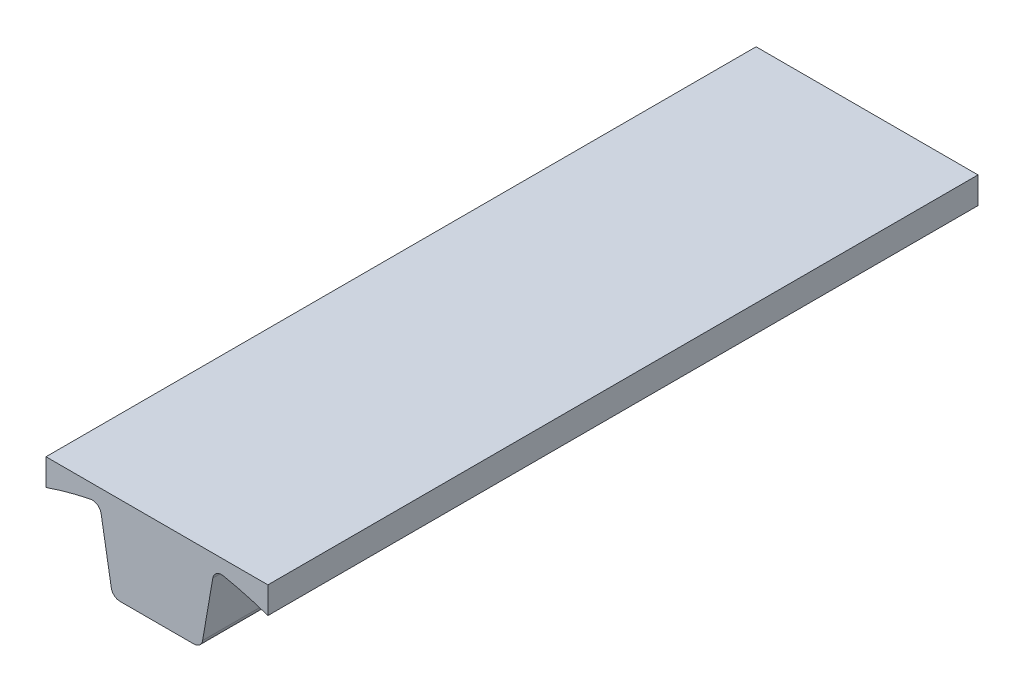
ISO-10303-21;
HEADER;
FILE_DESCRIPTION(('STEP AP214'),'2;1');
FILE_NAME('part.step','',(''),(''),'','','');
FILE_SCHEMA(('AUTOMOTIVE_DESIGN { 1 0 10303 214 1 1 1 1 }'));
ENDSEC;
DATA;
#1=APPLICATION_CONTEXT('core data for automotive mechanical design processes');
#2=APPLICATION_PROTOCOL_DEFINITION('international standard','automotive_design',2000,#1);
#3=PRODUCT_CONTEXT('',#1,'mechanical');
#4=PRODUCT('Part','Part','',(#3));
#5=PRODUCT_RELATED_PRODUCT_CATEGORY('part','',(#4));
#6=PRODUCT_DEFINITION_FORMATION('','',#4);
#7=PRODUCT_DEFINITION_CONTEXT('part definition',#1,'design');
#8=PRODUCT_DEFINITION('design','',#6,#7);
#9=PRODUCT_DEFINITION_SHAPE('','',#8);
#10=(LENGTH_UNIT() NAMED_UNIT(*) SI_UNIT(.MILLI.,.METRE.));
#11=(NAMED_UNIT(*) PLANE_ANGLE_UNIT() SI_UNIT($,.RADIAN.));
#12=(NAMED_UNIT(*) SI_UNIT($,.STERADIAN.) SOLID_ANGLE_UNIT());
#13=UNCERTAINTY_MEASURE_WITH_UNIT(LENGTH_MEASURE(1.E-05),#10,'distance_accuracy_value','');
#14=(GEOMETRIC_REPRESENTATION_CONTEXT(3) GLOBAL_UNCERTAINTY_ASSIGNED_CONTEXT((#13)) GLOBAL_UNIT_ASSIGNED_CONTEXT((#10,
#11,#12)) REPRESENTATION_CONTEXT('',''));
#15=CARTESIAN_POINT('',(0.,0.,0.));
#16=DIRECTION('',(0.,0.,1.));
#17=DIRECTION('',(1.,0.,0.));
#18=AXIS2_PLACEMENT_3D('',#15,#16,#17);
#19=CARTESIAN_POINT('',(12.7,73.8463201327698,203.2));
#20=DIRECTION('',(-0.985526486983063,0.169521513250743,0.));
#21=DIRECTION('',(-0.169521513250743,-0.985526486983063,0.));
#22=AXIS2_PLACEMENT_3D('',#19,#20,#21);
#23=PLANE('',#22);
#24=DIRECTION('',(0.169521513250743,0.985526486983063,0.));
#25=VECTOR('',#24,1.);
#26=CARTESIAN_POINT('',(12.7,73.8463201327698,203.2));
#27=LINE('',#26,#25);
#28=CARTESIAN_POINT('',(13.0628428946403,75.955735489113,203.2));
#29=VERTEX_POINT('',#28);
#30=CARTESIAN_POINT('',(15.9773459814521,92.8994256047058,203.2));
#31=VERTEX_POINT('',#30);
#32=EDGE_CURVE('E137',#29,#31,#27,.T.);
#33=ORIENTED_EDGE('',*,*,#32,.F.);
#34=DIRECTION('',(0.,0.,-1.));
#35=VECTOR('',#34,1.);
#36=CARTESIAN_POINT('',(13.0628428946403,75.955735489113,203.2));
#37=LINE('',#36,#35);
#38=CARTESIAN_POINT('',(13.0628428946403,75.955735489113,0.));
#39=VERTEX_POINT('',#38);
#40=EDGE_CURVE('E11',#29,#39,#37,.T.);
#41=ORIENTED_EDGE('',*,*,#40,.T.);
#42=DIRECTION('',(0.169521513250743,0.985526486983063,0.));
#43=VECTOR('',#42,1.);
#44=CARTESIAN_POINT('',(12.7,73.8463201327698,0.));
#45=LINE('',#44,#43);
#46=CARTESIAN_POINT('',(15.9773459814521,92.8994256047058,0.));
#47=VERTEX_POINT('',#46);
#48=EDGE_CURVE('E167',#39,#47,#45,.T.);
#49=ORIENTED_EDGE('',*,*,#48,.T.);
#50=DIRECTION('',(0.,0.,1.));
#51=VECTOR('',#50,1.);
#52=CARTESIAN_POINT('',(15.9773459814521,92.8994256047058,203.2));
#53=LINE('',#52,#51);
#54=EDGE_CURVE('E192',#47,#31,#53,.T.);
#55=ORIENTED_EDGE('',*,*,#54,.T.);
#56=EDGE_LOOP('',(#33,#41,#49,#55));
#57=FACE_BOUND('',#56,.T.);
#58=ADVANCED_FACE('F36',(#57),#23,.F.);
#59=CARTESIAN_POINT('',(0.,0.,203.2));
#60=DIRECTION('',(0.,0.,-1.));
#61=DIRECTION('',(-1.,0.,0.));
#62=AXIS2_PLACEMENT_3D('',#59,#60,#61);
#63=CYLINDRICAL_SURFACE('',#62,96.8375);
#64=CARTESIAN_POINT('',(0.,0.,203.2));
#65=DIRECTION('',(0.,0.,-1.));
#66=DIRECTION('',(-1.,0.,0.));
#67=AXIS2_PLACEMENT_3D('',#64,#65,#66);
#68=CIRCLE('',#67,96.8375);
#69=CARTESIAN_POINT('',(18.9783767468306,94.9595841519189,203.2));
#70=VERTEX_POINT('',#69);
#71=CARTESIAN_POINT('',(31.75,91.4846375423218,203.2));
#72=VERTEX_POINT('',#71);
#73=EDGE_CURVE('E126',#70,#72,#68,.T.);
#74=ORIENTED_EDGE('',*,*,#73,.F.);
#75=DIRECTION('',(0.,0.,-1.));
#76=VECTOR('',#75,1.);
#77=CARTESIAN_POINT('',(18.9783767468306,94.9595841519189,203.2));
#78=LINE('',#77,#76);
#79=CARTESIAN_POINT('',(18.9783767468306,94.9595841519189,0.));
#80=VERTEX_POINT('',#79);
#81=EDGE_CURVE('E146',#70,#80,#78,.T.);
#82=ORIENTED_EDGE('',*,*,#81,.T.);
#83=CARTESIAN_POINT('',(0.,0.,0.));
#84=DIRECTION('',(0.,0.,-1.));
#85=DIRECTION('',(-1.,0.,0.));
#86=AXIS2_PLACEMENT_3D('',#83,#84,#85);
#87=CIRCLE('',#86,96.8375);
#88=CARTESIAN_POINT('',(31.75,91.4846375423218,0.));
#89=VERTEX_POINT('',#88);
#90=EDGE_CURVE('E143',#80,#89,#87,.T.);
#91=ORIENTED_EDGE('',*,*,#90,.T.);
#92=DIRECTION('',(0.,0.,-1.));
#93=VECTOR('',#92,1.);
#94=CARTESIAN_POINT('',(31.75,91.4846375423218,203.2));
#95=LINE('',#94,#93);
#96=EDGE_CURVE('E140',#72,#89,#95,.T.);
#97=ORIENTED_EDGE('',*,*,#96,.F.);
#98=EDGE_LOOP('',(#74,#82,#91,#97));
#99=FACE_BOUND('',#98,.T.);
#100=ADVANCED_FACE('F141',(#99),#63,.F.);
#101=CARTESIAN_POINT('',(31.75,91.4846375423218,203.2));
#102=DIRECTION('',(-1.,0.,0.));
#103=DIRECTION('',(0.,0.,1.));
#104=AXIS2_PLACEMENT_3D('',#101,#102,#103);
#105=PLANE('',#104);
#106=DIRECTION('',(0.,1.,0.));
#107=VECTOR('',#106,1.);
#108=CARTESIAN_POINT('',(31.75,91.4846375423218,0.));
#109=LINE('',#108,#107);
#110=CARTESIAN_POINT('',(31.75,99.1046375423218,0.));
#111=VERTEX_POINT('',#110);
#112=EDGE_CURVE('E171',#89,#111,#109,.T.);
#113=ORIENTED_EDGE('',*,*,#112,.T.);
#114=DIRECTION('',(0.,0.,-1.));
#115=VECTOR('',#114,1.);
#116=CARTESIAN_POINT('',(31.75,99.1046375423218,203.2));
#117=LINE('',#116,#115);
#118=CARTESIAN_POINT('',(31.75,99.1046375423218,203.2));
#119=VERTEX_POINT('',#118);
#120=EDGE_CURVE('E147',#119,#111,#117,.T.);
#121=ORIENTED_EDGE('',*,*,#120,.F.);
#122=DIRECTION('',(0.,1.,0.));
#123=VECTOR('',#122,1.);
#124=CARTESIAN_POINT('',(31.75,91.4846375423218,203.2));
#125=LINE('',#124,#123);
#126=EDGE_CURVE('E130',#72,#119,#125,.T.);
#127=ORIENTED_EDGE('',*,*,#126,.F.);
#128=ORIENTED_EDGE('',*,*,#96,.T.);
#129=EDGE_LOOP('',(#113,#121,#127,#128));
#130=FACE_BOUND('',#129,.T.);
#131=ADVANCED_FACE('F149',(#130),#105,.F.);
#132=CARTESIAN_POINT('',(31.75,99.1046375423218,203.2));
#133=DIRECTION('',(0.,-1.,0.));
#134=DIRECTION('',(1.,0.,0.));
#135=AXIS2_PLACEMENT_3D('',#132,#133,#134);
#136=PLANE('',#135);
#137=DIRECTION('',(-1.,0.,0.));
#138=VECTOR('',#137,1.);
#139=CARTESIAN_POINT('',(31.75,99.1046375423218,0.));
#140=LINE('',#139,#138);
#141=CARTESIAN_POINT('',(-31.75,99.1046375423218,0.));
#142=VERTEX_POINT('',#141);
#143=EDGE_CURVE('E173',#111,#142,#140,.T.);
#144=ORIENTED_EDGE('',*,*,#143,.T.);
#145=DIRECTION('',(0.,0.,-1.));
#146=VECTOR('',#145,1.);
#147=CARTESIAN_POINT('',(-31.75,99.1046375423218,203.2));
#148=LINE('',#147,#146);
#149=CARTESIAN_POINT('',(-31.75,99.1046375423218,203.2));
#150=VERTEX_POINT('',#149);
#151=EDGE_CURVE('E187',#150,#142,#148,.T.);
#152=ORIENTED_EDGE('',*,*,#151,.F.);
#153=DIRECTION('',(-1.,0.,0.));
#154=VECTOR('',#153,1.);
#155=CARTESIAN_POINT('',(31.75,99.1046375423218,203.2));
#156=LINE('',#155,#154);
#157=EDGE_CURVE('E152',#119,#150,#156,.T.);
#158=ORIENTED_EDGE('',*,*,#157,.F.);
#159=ORIENTED_EDGE('',*,*,#120,.T.);
#160=EDGE_LOOP('',(#144,#152,#158,#159));
#161=FACE_BOUND('',#160,.T.);
#162=ADVANCED_FACE('F248',(#161),#136,.F.);
#163=CARTESIAN_POINT('',(-31.75,91.4846375423218,203.2));
#164=DIRECTION('',(1.,0.,0.));
#165=DIRECTION('',(0.,0.,-1.));
#166=AXIS2_PLACEMENT_3D('',#163,#164,#165);
#167=PLANE('',#166);
#168=DIRECTION('',(0.,-1.,0.));
#169=VECTOR('',#168,1.);
#170=CARTESIAN_POINT('',(-31.75,91.4846375423218,0.));
#171=LINE('',#170,#169);
#172=CARTESIAN_POINT('',(-31.75,91.4846375423218,0.));
#173=VERTEX_POINT('',#172);
#174=EDGE_CURVE('E175',#142,#173,#171,.T.);
#175=ORIENTED_EDGE('',*,*,#174,.T.);
#176=DIRECTION('',(0.,0.,-1.));
#177=VECTOR('',#176,1.);
#178=CARTESIAN_POINT('',(-31.75,91.4846375423218,203.2));
#179=LINE('',#178,#177);
#180=CARTESIAN_POINT('',(-31.75,91.4846375423218,203.2));
#181=VERTEX_POINT('',#180);
#182=EDGE_CURVE('E166',#181,#173,#179,.T.);
#183=ORIENTED_EDGE('',*,*,#182,.F.);
#184=DIRECTION('',(0.,-1.,0.));
#185=VECTOR('',#184,1.);
#186=CARTESIAN_POINT('',(-31.75,91.4846375423218,203.2));
#187=LINE('',#186,#185);
#188=EDGE_CURVE('E154',#150,#181,#187,.T.);
#189=ORIENTED_EDGE('',*,*,#188,.F.);
#190=ORIENTED_EDGE('',*,*,#151,.T.);
#191=EDGE_LOOP('',(#175,#183,#189,#190));
#192=FACE_BOUND('',#191,.T.);
#193=ADVANCED_FACE('F244',(#192),#167,.F.);
#194=CARTESIAN_POINT('',(0.,0.,203.2));
#195=DIRECTION('',(0.,0.,-1.));
#196=DIRECTION('',(-1.,0.,0.));
#197=AXIS2_PLACEMENT_3D('',#194,#195,#196);
#198=CYLINDRICAL_SURFACE('',#197,96.8374999999999);
#199=CARTESIAN_POINT('',(0.,0.,0.));
#200=DIRECTION('',(0.,0.,-1.));
#201=DIRECTION('',(1.,0.,0.));
#202=AXIS2_PLACEMENT_3D('',#199,#200,#201);
#203=CIRCLE('',#202,96.8374999999999);
#204=CARTESIAN_POINT('',(-18.9783767468306,94.9595841519188,0.));
#205=VERTEX_POINT('',#204);
#206=EDGE_CURVE('E177',#173,#205,#203,.T.);
#207=ORIENTED_EDGE('',*,*,#206,.T.);
#208=DIRECTION('',(0.,0.,-1.));
#209=VECTOR('',#208,1.);
#210=CARTESIAN_POINT('',(-18.9783767468306,94.9595841519188,203.2));
#211=LINE('',#210,#209);
#212=CARTESIAN_POINT('',(-18.9783767468306,94.9595841519188,203.2));
#213=VERTEX_POINT('',#212);
#214=EDGE_CURVE('E202',#205,#213,#211,.F.);
#215=ORIENTED_EDGE('',*,*,#214,.T.);
#216=CARTESIAN_POINT('',(0.,0.,203.2));
#217=DIRECTION('',(0.,0.,-1.));
#218=DIRECTION('',(1.,0.,0.));
#219=AXIS2_PLACEMENT_3D('',#216,#217,#218);
#220=CIRCLE('',#219,96.8374999999999);
#221=EDGE_CURVE('E159',#181,#213,#220,.T.);
#222=ORIENTED_EDGE('',*,*,#221,.F.);
#223=ORIENTED_EDGE('',*,*,#182,.T.);
#224=EDGE_LOOP('',(#207,#215,#222,#223));
#225=FACE_BOUND('',#224,.T.);
#226=ADVANCED_FACE('F239',(#225),#198,.F.);
#227=CARTESIAN_POINT('',(-12.7,73.8463201327698,203.2));
#228=DIRECTION('',(0.985526486983063,0.169521513250743,0.));
#229=DIRECTION('',(-0.169521513250743,0.985526486983063,0.));
#230=AXIS2_PLACEMENT_3D('',#227,#228,#229);
#231=PLANE('',#230);
#232=DIRECTION('',(0.169521513250743,-0.985526486983063,0.));
#233=VECTOR('',#232,1.);
#234=CARTESIAN_POINT('',(-12.7,73.8463201327698,0.));
#235=LINE('',#234,#233);
#236=CARTESIAN_POINT('',(-15.9773459814521,92.8994256047057,0.));
#237=VERTEX_POINT('',#236);
#238=CARTESIAN_POINT('',(-13.0628428946403,75.9557354891129,0.));
#239=VERTEX_POINT('',#238);
#240=EDGE_CURVE('E180',#237,#239,#235,.T.);
#241=ORIENTED_EDGE('',*,*,#240,.T.);
#242=DIRECTION('',(0.,0.,-1.));
#243=VECTOR('',#242,1.);
#244=CARTESIAN_POINT('',(-13.0628428946403,75.9557354891129,203.2));
#245=LINE('',#244,#243);
#246=CARTESIAN_POINT('',(-13.0628428946403,75.9557354891129,203.2));
#247=VERTEX_POINT('',#246);
#248=EDGE_CURVE('E59',#239,#247,#245,.F.);
#249=ORIENTED_EDGE('',*,*,#248,.T.);
#250=DIRECTION('',(0.169521513250743,-0.985526486983063,0.));
#251=VECTOR('',#250,1.);
#252=CARTESIAN_POINT('',(-12.7,73.8463201327698,203.2));
#253=LINE('',#252,#251);
#254=CARTESIAN_POINT('',(-15.9773459814521,92.8994256047057,203.2));
#255=VERTEX_POINT('',#254);
#256=EDGE_CURVE('E162',#255,#247,#253,.T.);
#257=ORIENTED_EDGE('',*,*,#256,.F.);
#258=DIRECTION('',(0.,0.,1.));
#259=VECTOR('',#258,1.);
#260=CARTESIAN_POINT('',(-15.9773459814521,92.8994256047057,0.));
#261=LINE('',#260,#259);
#262=EDGE_CURVE('E199',#255,#237,#261,.F.);
#263=ORIENTED_EDGE('',*,*,#262,.T.);
#264=EDGE_LOOP('',(#241,#249,#257,#263));
#265=FACE_BOUND('',#264,.T.);
#266=ADVANCED_FACE('F230',(#265),#231,.F.);
#267=CARTESIAN_POINT('',(-12.7,73.8463201327698,203.2));
#268=DIRECTION('',(0.,1.,0.));
#269=DIRECTION('',(-1.,0.,0.));
#270=AXIS2_PLACEMENT_3D('',#267,#268,#269);
#271=PLANE('',#270);
#272=DIRECTION('',(1.,0.,0.));
#273=VECTOR('',#272,1.);
#274=CARTESIAN_POINT('',(-12.7,73.8463201327698,203.2));
#275=LINE('',#274,#273);
#276=CARTESIAN_POINT('',(-10.5596056177033,73.8463201327698,203.2));
#277=VERTEX_POINT('',#276);
#278=CARTESIAN_POINT('',(10.5596056177033,73.8463201327698,203.2));
#279=VERTEX_POINT('',#278);
#280=EDGE_CURVE('E164',#277,#279,#275,.T.);
#281=ORIENTED_EDGE('',*,*,#280,.F.);
#282=DIRECTION('',(0.,0.,-1.));
#283=VECTOR('',#282,1.);
#284=CARTESIAN_POINT('',(-10.5596056177033,73.8463201327698,203.2));
#285=LINE('',#284,#283);
#286=CARTESIAN_POINT('',(-10.5596056177033,73.8463201327698,0.));
#287=VERTEX_POINT('',#286);
#288=EDGE_CURVE('E210',#277,#287,#285,.T.);
#289=ORIENTED_EDGE('',*,*,#288,.T.);
#290=DIRECTION('',(1.,0.,0.));
#291=VECTOR('',#290,1.);
#292=CARTESIAN_POINT('',(-12.7,73.8463201327698,0.));
#293=LINE('',#292,#291);
#294=CARTESIAN_POINT('',(10.5596056177033,73.8463201327698,0.));
#295=VERTEX_POINT('',#294);
#296=EDGE_CURVE('E182',#287,#295,#293,.T.);
#297=ORIENTED_EDGE('',*,*,#296,.T.);
#298=DIRECTION('',(0.,0.,-1.));
#299=VECTOR('',#298,1.);
#300=CARTESIAN_POINT('',(10.5596056177033,73.8463201327698,203.2));
#301=LINE('',#300,#299);
#302=EDGE_CURVE('E208',#295,#279,#301,.F.);
#303=ORIENTED_EDGE('',*,*,#302,.T.);
#304=EDGE_LOOP('',(#281,#289,#297,#303));
#305=FACE_BOUND('',#304,.T.);
#306=ADVANCED_FACE('F223',(#305),#271,.F.);
#307=CARTESIAN_POINT('',(0.,0.,203.2));
#308=DIRECTION('',(0.,0.,-1.));
#309=DIRECTION('',(-1.,0.,0.));
#310=AXIS2_PLACEMENT_3D('',#307,#308,#309);
#311=PLANE('',#310);
#312=ORIENTED_EDGE('',*,*,#256,.T.);
#313=CARTESIAN_POINT('',(-10.5596056177033,76.3863201327698,203.2));
#314=DIRECTION('',(0.,0.,-1.));
#315=DIRECTION('',(-1.,0.,0.));
#316=AXIS2_PLACEMENT_3D('',#313,#314,#315);
#317=CIRCLE('',#316,2.54);
#318=EDGE_CURVE('E44',#247,#277,#317,.F.);
#319=ORIENTED_EDGE('',*,*,#318,.T.);
#320=ORIENTED_EDGE('',*,*,#280,.T.);
#321=CARTESIAN_POINT('',(10.5596056177033,76.3863201327698,203.2));
#322=DIRECTION('',(0.,0.,-1.));
#323=DIRECTION('',(-1.,0.,0.));
#324=AXIS2_PLACEMENT_3D('',#321,#322,#323);
#325=CIRCLE('',#324,2.54);
#326=EDGE_CURVE('E51',#279,#29,#325,.F.);
#327=ORIENTED_EDGE('',*,*,#326,.T.);
#328=ORIENTED_EDGE('',*,*,#32,.T.);
#329=CARTESIAN_POINT('',(18.4805832583891,92.4688409610489,203.2));
#330=DIRECTION('',(0.,0.,-1.));
#331=DIRECTION('',(-1.,0.,0.));
#332=AXIS2_PLACEMENT_3D('',#329,#330,#331);
#333=CIRCLE('',#332,2.54);
#334=EDGE_CURVE('E133',#31,#70,#333,.T.);
#335=ORIENTED_EDGE('',*,*,#334,.T.);
#336=ORIENTED_EDGE('',*,*,#73,.T.);
#337=ORIENTED_EDGE('',*,*,#126,.T.);
#338=ORIENTED_EDGE('',*,*,#157,.T.);
#339=ORIENTED_EDGE('',*,*,#188,.T.);
#340=ORIENTED_EDGE('',*,*,#221,.T.);
#341=CARTESIAN_POINT('',(-18.4805832583891,92.4688409610488,203.2));
#342=DIRECTION('',(0.,0.,-1.));
#343=DIRECTION('',(-1.,0.,0.));
#344=AXIS2_PLACEMENT_3D('',#341,#342,#343);
#345=CIRCLE('',#344,2.54);
#346=EDGE_CURVE('E206',#213,#255,#345,.T.);
#347=ORIENTED_EDGE('',*,*,#346,.T.);
#348=EDGE_LOOP('',(#312,#319,#320,#327,#328,#335,#336,#337,#338,#339,#340,#347));
#349=FACE_BOUND('',#348,.T.);
#350=ADVANCED_FACE('F128',(#349),#311,.F.);
#351=CARTESIAN_POINT('',(0.,0.,0.));
#352=DIRECTION('',(0.,0.,-1.));
#353=DIRECTION('',(-1.,0.,0.));
#354=AXIS2_PLACEMENT_3D('',#351,#352,#353);
#355=PLANE('',#354);
#356=CARTESIAN_POINT('',(0.,80.0546375423218,0.));
#357=DIRECTION('',(0.,0.,-1.));
#358=DIRECTION('',(-1.,0.,0.));
#359=AXIS2_PLACEMENT_3D('',#356,#357,#358);
#360=CIRCLE('',#359,2.667);
#361=CARTESIAN_POINT('',(-2.667,80.0546375423218,0.));
#362=VERTEX_POINT('',#361);
#363=EDGE_CURVE('E298',#362,#362,#360,.T.);
#364=ORIENTED_EDGE('',*,*,#363,.F.);
#365=EDGE_LOOP('',(#364));
#366=FACE_BOUND('',#365,.T.);
#367=CARTESIAN_POINT('',(-8.89,92.7546375423218,0.));
#368=DIRECTION('',(0.,0.,-1.));
#369=DIRECTION('',(-1.,0.,0.));
#370=AXIS2_PLACEMENT_3D('',#367,#368,#369);
#371=CIRCLE('',#370,2.667);
#372=CARTESIAN_POINT('',(-11.557,92.7546375423218,0.));
#373=VERTEX_POINT('',#372);
#374=EDGE_CURVE('E295',#373,#373,#371,.T.);
#375=ORIENTED_EDGE('',*,*,#374,.F.);
#376=EDGE_LOOP('',(#375));
#377=FACE_BOUND('',#376,.T.);
#378=CARTESIAN_POINT('',(8.89,92.7546375423218,0.));
#379=DIRECTION('',(0.,0.,-1.));
#380=DIRECTION('',(-1.,0.,0.));
#381=AXIS2_PLACEMENT_3D('',#378,#379,#380);
#382=CIRCLE('',#381,2.667);
#383=CARTESIAN_POINT('',(6.223,92.7546375423218,0.));
#384=VERTEX_POINT('',#383);
#385=EDGE_CURVE('E289',#384,#384,#382,.T.);
#386=ORIENTED_EDGE('',*,*,#385,.F.);
#387=EDGE_LOOP('',(#386));
#388=FACE_BOUND('',#387,.T.);
#389=ORIENTED_EDGE('',*,*,#296,.F.);
#390=CARTESIAN_POINT('',(-10.5596056177033,76.3863201327698,0.));
#391=DIRECTION('',(0.,0.,-1.));
#392=DIRECTION('',(-1.,0.,0.));
#393=AXIS2_PLACEMENT_3D('',#390,#391,#392);
#394=CIRCLE('',#393,2.54);
#395=EDGE_CURVE('E215',#287,#239,#394,.T.);
#396=ORIENTED_EDGE('',*,*,#395,.T.);
#397=ORIENTED_EDGE('',*,*,#240,.F.);
#398=CARTESIAN_POINT('',(-18.4805832583891,92.4688409610488,0.));
#399=DIRECTION('',(0.,0.,-1.));
#400=DIRECTION('',(-1.,0.,0.));
#401=AXIS2_PLACEMENT_3D('',#398,#399,#400);
#402=CIRCLE('',#401,2.54);
#403=EDGE_CURVE('E204',#237,#205,#402,.F.);
#404=ORIENTED_EDGE('',*,*,#403,.T.);
#405=ORIENTED_EDGE('',*,*,#206,.F.);
#406=ORIENTED_EDGE('',*,*,#174,.F.);
#407=ORIENTED_EDGE('',*,*,#143,.F.);
#408=ORIENTED_EDGE('',*,*,#112,.F.);
#409=ORIENTED_EDGE('',*,*,#90,.F.);
#410=CARTESIAN_POINT('',(18.4805832583891,92.4688409610489,0.));
#411=DIRECTION('',(0.,0.,-1.));
#412=DIRECTION('',(-1.,0.,0.));
#413=AXIS2_PLACEMENT_3D('',#410,#411,#412);
#414=CIRCLE('',#413,2.54);
#415=EDGE_CURVE('E195',#80,#47,#414,.F.);
#416=ORIENTED_EDGE('',*,*,#415,.T.);
#417=ORIENTED_EDGE('',*,*,#48,.F.);
#418=CARTESIAN_POINT('',(10.5596056177033,76.3863201327698,0.));
#419=DIRECTION('',(0.,0.,-1.));
#420=DIRECTION('',(-1.,0.,0.));
#421=AXIS2_PLACEMENT_3D('',#418,#419,#420);
#422=CIRCLE('',#421,2.54);
#423=EDGE_CURVE('E213',#39,#295,#422,.T.);
#424=ORIENTED_EDGE('',*,*,#423,.T.);
#425=EDGE_LOOP('',(#389,#396,#397,#404,#405,#406,#407,#408,#409,#416,#417,#424));
#426=FACE_BOUND('',#425,.T.);
#427=ADVANCED_FACE('F229',(#366,#377,#388,#426),#355,.T.);
#428=CARTESIAN_POINT('',(18.4805832583891,92.4688409610489,203.2));
#429=DIRECTION('',(0.,0.,-1.));
#430=DIRECTION('',(-1.,0.,0.));
#431=AXIS2_PLACEMENT_3D('',#428,#429,#430);
#432=CYLINDRICAL_SURFACE('',#431,2.54);
#433=ORIENTED_EDGE('',*,*,#334,.F.);
#434=ORIENTED_EDGE('',*,*,#54,.F.);
#435=ORIENTED_EDGE('',*,*,#415,.F.);
#436=ORIENTED_EDGE('',*,*,#81,.F.);
#437=EDGE_LOOP('',(#433,#434,#435,#436));
#438=FACE_BOUND('',#437,.T.);
#439=ADVANCED_FACE('F265',(#438),#432,.F.);
#440=CARTESIAN_POINT('',(-18.4805832583891,92.4688409610488,203.2));
#441=DIRECTION('',(0.,0.,-1.));
#442=DIRECTION('',(-1.,0.,0.));
#443=AXIS2_PLACEMENT_3D('',#440,#441,#442);
#444=CYLINDRICAL_SURFACE('',#443,2.54);
#445=ORIENTED_EDGE('',*,*,#346,.F.);
#446=ORIENTED_EDGE('',*,*,#214,.F.);
#447=ORIENTED_EDGE('',*,*,#403,.F.);
#448=ORIENTED_EDGE('',*,*,#262,.F.);
#449=EDGE_LOOP('',(#445,#446,#447,#448));
#450=FACE_BOUND('',#449,.T.);
#451=ADVANCED_FACE('F234',(#450),#444,.F.);
#452=CARTESIAN_POINT('',(-10.5596056177033,76.3863201327698,203.2));
#453=DIRECTION('',(0.,0.,-1.));
#454=DIRECTION('',(-1.,0.,0.));
#455=AXIS2_PLACEMENT_3D('',#452,#453,#454);
#456=CYLINDRICAL_SURFACE('',#455,2.54);
#457=ORIENTED_EDGE('',*,*,#318,.F.);
#458=ORIENTED_EDGE('',*,*,#248,.F.);
#459=ORIENTED_EDGE('',*,*,#395,.F.);
#460=ORIENTED_EDGE('',*,*,#288,.F.);
#461=EDGE_LOOP('',(#457,#458,#459,#460));
#462=FACE_BOUND('',#461,.T.);
#463=ADVANCED_FACE('F226',(#462),#456,.T.);
#464=CARTESIAN_POINT('',(10.5596056177033,76.3863201327698,203.2));
#465=DIRECTION('',(0.,0.,-1.));
#466=DIRECTION('',(-1.,0.,0.));
#467=AXIS2_PLACEMENT_3D('',#464,#465,#466);
#468=CYLINDRICAL_SURFACE('',#467,2.54);
#469=ORIENTED_EDGE('',*,*,#326,.F.);
#470=ORIENTED_EDGE('',*,*,#302,.F.);
#471=ORIENTED_EDGE('',*,*,#423,.F.);
#472=ORIENTED_EDGE('',*,*,#40,.F.);
#473=EDGE_LOOP('',(#469,#470,#471,#472));
#474=FACE_BOUND('',#473,.T.);
#475=ADVANCED_FACE('F38',(#474),#468,.T.);
#476=CARTESIAN_POINT('',(8.89,92.7546375423218,11.43));
#477=DIRECTION('',(0.,0.,-1.));
#478=DIRECTION('',(-1.,0.,0.));
#479=AXIS2_PLACEMENT_3D('',#476,#477,#478);
#480=CYLINDRICAL_SURFACE('',#479,2.667);
#481=CARTESIAN_POINT('',(8.89,92.7546375423218,11.43));
#482=DIRECTION('',(0.,0.,-1.));
#483=DIRECTION('',(-1.,0.,0.));
#484=AXIS2_PLACEMENT_3D('',#481,#482,#483);
#485=CIRCLE('',#484,2.667);
#486=CARTESIAN_POINT('',(6.223,92.7546375423218,11.43));
#487=VERTEX_POINT('',#486);
#488=EDGE_CURVE('E286',#487,#487,#485,.T.);
#489=ORIENTED_EDGE('',*,*,#488,.F.);
#490=EDGE_LOOP('',(#489));
#491=FACE_BOUND('',#490,.T.);
#492=ORIENTED_EDGE('',*,*,#385,.T.);
#493=EDGE_LOOP('',(#492));
#494=FACE_BOUND('',#493,.T.);
#495=ADVANCED_FACE('F274',(#491,#494),#480,.F.);
#496=CARTESIAN_POINT('',(8.89,92.7546375423218,11.43));
#497=DIRECTION('',(0.,0.,-1.));
#498=DIRECTION('',(-1.,0.,0.));
#499=AXIS2_PLACEMENT_3D('',#496,#497,#498);
#500=PLANE('',#499);
#501=ORIENTED_EDGE('',*,*,#488,.T.);
#502=EDGE_LOOP('',(#501));
#503=FACE_BOUND('',#502,.T.);
#504=ADVANCED_FACE('F279',(#503),#500,.T.);
#505=CARTESIAN_POINT('',(-8.89,92.7546375423218,11.43));
#506=DIRECTION('',(0.,0.,-1.));
#507=DIRECTION('',(-1.,0.,0.));
#508=AXIS2_PLACEMENT_3D('',#505,#506,#507);
#509=CYLINDRICAL_SURFACE('',#508,2.667);
#510=CARTESIAN_POINT('',(-8.89,92.7546375423218,11.43));
#511=DIRECTION('',(0.,0.,-1.));
#512=DIRECTION('',(-1.,0.,0.));
#513=AXIS2_PLACEMENT_3D('',#510,#511,#512);
#514=CIRCLE('',#513,2.667);
#515=CARTESIAN_POINT('',(-11.557,92.7546375423218,11.43));
#516=VERTEX_POINT('',#515);
#517=EDGE_CURVE('E292',#516,#516,#514,.T.);
#518=ORIENTED_EDGE('',*,*,#517,.F.);
#519=EDGE_LOOP('',(#518));
#520=FACE_BOUND('',#519,.T.);
#521=ORIENTED_EDGE('',*,*,#374,.T.);
#522=EDGE_LOOP('',(#521));
#523=FACE_BOUND('',#522,.T.);
#524=ADVANCED_FACE('F321',(#520,#523),#509,.F.);
#525=CARTESIAN_POINT('',(-8.89,92.7546375423218,11.43));
#526=DIRECTION('',(0.,0.,-1.));
#527=DIRECTION('',(-1.,0.,0.));
#528=AXIS2_PLACEMENT_3D('',#525,#526,#527);
#529=PLANE('',#528);
#530=ORIENTED_EDGE('',*,*,#517,.T.);
#531=EDGE_LOOP('',(#530));
#532=FACE_BOUND('',#531,.T.);
#533=ADVANCED_FACE('F309',(#532),#529,.T.);
#534=CARTESIAN_POINT('',(0.,80.0546375423218,11.43));
#535=DIRECTION('',(0.,0.,-1.));
#536=DIRECTION('',(-1.,0.,0.));
#537=AXIS2_PLACEMENT_3D('',#534,#535,#536);
#538=CYLINDRICAL_SURFACE('',#537,2.667);
#539=CARTESIAN_POINT('',(0.,80.0546375423218,11.43));
#540=DIRECTION('',(0.,0.,-1.));
#541=DIRECTION('',(-1.,0.,0.));
#542=AXIS2_PLACEMENT_3D('',#539,#540,#541);
#543=CIRCLE('',#542,2.667);
#544=CARTESIAN_POINT('',(-2.667,80.0546375423218,11.43));
#545=VERTEX_POINT('',#544);
#546=EDGE_CURVE('E169',#545,#545,#543,.T.);
#547=ORIENTED_EDGE('',*,*,#546,.F.);
#548=EDGE_LOOP('',(#547));
#549=FACE_BOUND('',#548,.T.);
#550=ORIENTED_EDGE('',*,*,#363,.T.);
#551=EDGE_LOOP('',(#550));
#552=FACE_BOUND('',#551,.T.);
#553=ADVANCED_FACE('F306',(#549,#552),#538,.F.);
#554=CARTESIAN_POINT('',(0.,80.0546375423218,11.43));
#555=DIRECTION('',(0.,0.,-1.));
#556=DIRECTION('',(-1.,0.,0.));
#557=AXIS2_PLACEMENT_3D('',#554,#555,#556);
#558=PLANE('',#557);
#559=ORIENTED_EDGE('',*,*,#546,.T.);
#560=EDGE_LOOP('',(#559));
#561=FACE_BOUND('',#560,.T.);
#562=ADVANCED_FACE('F304',(#561),#558,.T.);
#563=CLOSED_SHELL('',(#58,#100,#131,#162,#193,#226,#266,#306,#350,#427,#439,#451,#463,#475,#495,
#504,#524,#533,#553,#562));
#564=MANIFOLD_SOLID_BREP('B2',#563);
#565=ADVANCED_BREP_SHAPE_REPRESENTATION('',(#18,#564),#14);
#566=SHAPE_DEFINITION_REPRESENTATION(#9,#565);
ENDSEC;
END-ISO-10303-21;
